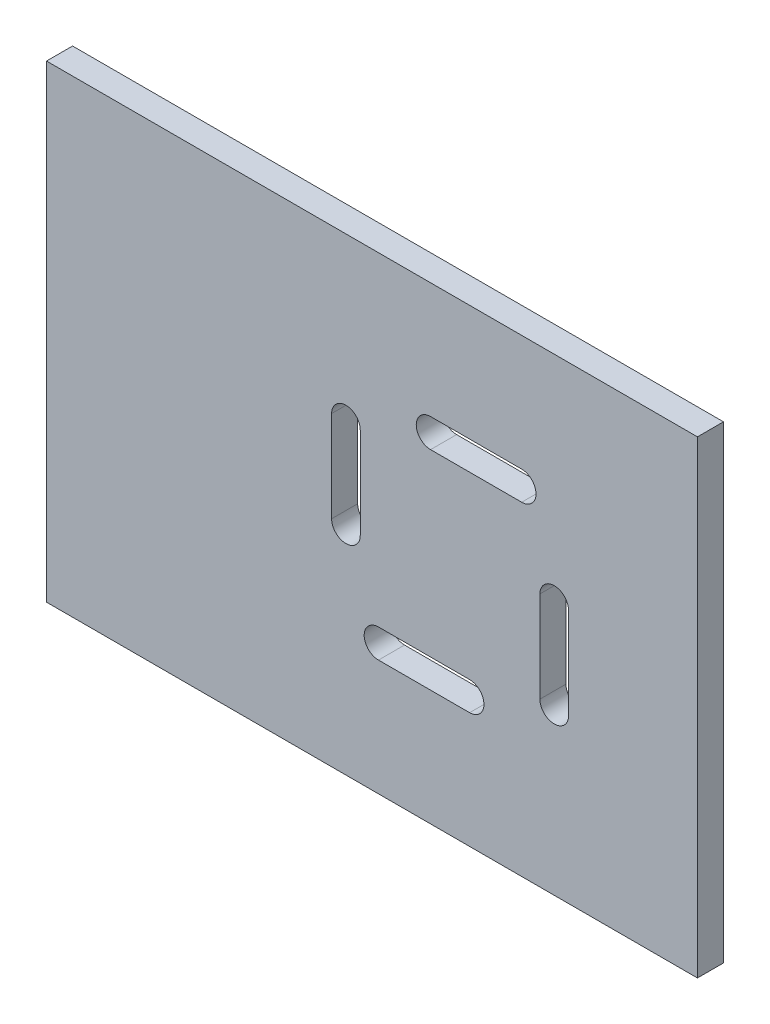
ISO-10303-21;
HEADER;
FILE_DESCRIPTION(('STEP AP214'),'2;1');
FILE_NAME('part.step','',(''),(''),'','','');
FILE_SCHEMA(('AUTOMOTIVE_DESIGN { 1 0 10303 214 1 1 1 1 }'));
ENDSEC;
DATA;
#1=APPLICATION_CONTEXT('core data for automotive mechanical design processes');
#2=APPLICATION_PROTOCOL_DEFINITION('international standard','automotive_design',2000,#1);
#3=PRODUCT_CONTEXT('',#1,'mechanical');
#4=PRODUCT('Part','Part','',(#3));
#5=PRODUCT_RELATED_PRODUCT_CATEGORY('part','',(#4));
#6=PRODUCT_DEFINITION_FORMATION('','',#4);
#7=PRODUCT_DEFINITION_CONTEXT('part definition',#1,'design');
#8=PRODUCT_DEFINITION('design','',#6,#7);
#9=PRODUCT_DEFINITION_SHAPE('','',#8);
#10=(LENGTH_UNIT() NAMED_UNIT(*) SI_UNIT(.MILLI.,.METRE.));
#11=(NAMED_UNIT(*) PLANE_ANGLE_UNIT() SI_UNIT($,.RADIAN.));
#12=(NAMED_UNIT(*) SI_UNIT($,.STERADIAN.) SOLID_ANGLE_UNIT());
#13=UNCERTAINTY_MEASURE_WITH_UNIT(LENGTH_MEASURE(1.E-05),#10,'distance_accuracy_value','');
#14=(GEOMETRIC_REPRESENTATION_CONTEXT(3) GLOBAL_UNCERTAINTY_ASSIGNED_CONTEXT((#13)) GLOBAL_UNIT_ASSIGNED_CONTEXT((#10,
#11,#12)) REPRESENTATION_CONTEXT('',''));
#15=CARTESIAN_POINT('',(0.,0.,0.));
#16=DIRECTION('',(0.,0.,1.));
#17=DIRECTION('',(1.,0.,0.));
#18=AXIS2_PLACEMENT_3D('',#15,#16,#17);
#19=CARTESIAN_POINT('',(-50.,40.,10.));
#20=DIRECTION('',(1.,0.,0.));
#21=DIRECTION('',(0.,1.,0.));
#22=AXIS2_PLACEMENT_3D('',#19,#20,#21);
#23=PLANE('',#22);
#24=DIRECTION('',(0.,-1.,0.));
#25=VECTOR('',#24,1.);
#26=CARTESIAN_POINT('',(-50.,40.,0.));
#27=LINE('',#26,#25);
#28=CARTESIAN_POINT('',(-50.,40.,0.));
#29=VERTEX_POINT('',#28);
#30=CARTESIAN_POINT('',(-50.,-140.,0.));
#31=VERTEX_POINT('',#30);
#32=EDGE_CURVE('E348',#29,#31,#27,.T.);
#33=ORIENTED_EDGE('',*,*,#32,.T.);
#34=DIRECTION('',(0.,0.,-1.));
#35=VECTOR('',#34,1.);
#36=CARTESIAN_POINT('',(-50.,-140.,10.));
#37=LINE('',#36,#35);
#38=CARTESIAN_POINT('',(-50.,-140.,10.));
#39=VERTEX_POINT('',#38);
#40=EDGE_CURVE('E11',#39,#31,#37,.T.);
#41=ORIENTED_EDGE('',*,*,#40,.F.);
#42=DIRECTION('',(0.,-1.,0.));
#43=VECTOR('',#42,1.);
#44=CARTESIAN_POINT('',(-50.,40.,10.));
#45=LINE('',#44,#43);
#46=CARTESIAN_POINT('',(-50.,40.,10.));
#47=VERTEX_POINT('',#46);
#48=EDGE_CURVE('E358',#47,#39,#45,.T.);
#49=ORIENTED_EDGE('',*,*,#48,.F.);
#50=DIRECTION('',(0.,0.,-1.));
#51=VECTOR('',#50,1.);
#52=CARTESIAN_POINT('',(-50.,40.,10.));
#53=LINE('',#52,#51);
#54=EDGE_CURVE('E372',#47,#29,#53,.T.);
#55=ORIENTED_EDGE('',*,*,#54,.T.);
#56=EDGE_LOOP('',(#33,#41,#49,#55));
#57=FACE_BOUND('',#56,.T.);
#58=ADVANCED_FACE('F39',(#57),#23,.F.);
#59=CARTESIAN_POINT('',(-50.,-140.,10.));
#60=DIRECTION('',(0.,1.,0.));
#61=DIRECTION('',(0.,0.,1.));
#62=AXIS2_PLACEMENT_3D('',#59,#60,#61);
#63=PLANE('',#62);
#64=DIRECTION('',(1.,0.,0.));
#65=VECTOR('',#64,1.);
#66=CARTESIAN_POINT('',(-50.,-140.,0.));
#67=LINE('',#66,#65);
#68=CARTESIAN_POINT('',(200.,-140.,0.));
#69=VERTEX_POINT('',#68);
#70=EDGE_CURVE('E376',#31,#69,#67,.T.);
#71=ORIENTED_EDGE('',*,*,#70,.T.);
#72=DIRECTION('',(0.,0.,-1.));
#73=VECTOR('',#72,1.);
#74=CARTESIAN_POINT('',(200.,-140.,10.));
#75=LINE('',#74,#73);
#76=CARTESIAN_POINT('',(200.,-140.,10.));
#77=VERTEX_POINT('',#76);
#78=EDGE_CURVE('E47',#77,#69,#75,.T.);
#79=ORIENTED_EDGE('',*,*,#78,.F.);
#80=DIRECTION('',(1.,0.,0.));
#81=VECTOR('',#80,1.);
#82=CARTESIAN_POINT('',(-50.,-140.,10.));
#83=LINE('',#82,#81);
#84=EDGE_CURVE('E362',#39,#77,#83,.T.);
#85=ORIENTED_EDGE('',*,*,#84,.F.);
#86=ORIENTED_EDGE('',*,*,#40,.T.);
#87=EDGE_LOOP('',(#71,#79,#85,#86));
#88=FACE_BOUND('',#87,.T.);
#89=ADVANCED_FACE('F411',(#88),#63,.F.);
#90=CARTESIAN_POINT('',(200.,40.,10.));
#91=DIRECTION('',(-1.,0.,0.));
#92=DIRECTION('',(0.,-1.,0.));
#93=AXIS2_PLACEMENT_3D('',#90,#91,#92);
#94=PLANE('',#93);
#95=DIRECTION('',(0.,1.,0.));
#96=VECTOR('',#95,1.);
#97=CARTESIAN_POINT('',(200.,40.,0.));
#98=LINE('',#97,#96);
#99=CARTESIAN_POINT('',(200.,40.,0.));
#100=VERTEX_POINT('',#99);
#101=EDGE_CURVE('E379',#69,#100,#98,.T.);
#102=ORIENTED_EDGE('',*,*,#101,.T.);
#103=DIRECTION('',(0.,0.,-1.));
#104=VECTOR('',#103,1.);
#105=CARTESIAN_POINT('',(200.,40.,10.));
#106=LINE('',#105,#104);
#107=CARTESIAN_POINT('',(200.,40.,10.));
#108=VERTEX_POINT('',#107);
#109=EDGE_CURVE('E387',#108,#100,#106,.T.);
#110=ORIENTED_EDGE('',*,*,#109,.F.);
#111=DIRECTION('',(0.,1.,0.));
#112=VECTOR('',#111,1.);
#113=CARTESIAN_POINT('',(200.,40.,10.));
#114=LINE('',#113,#112);
#115=EDGE_CURVE('E366',#77,#108,#114,.T.);
#116=ORIENTED_EDGE('',*,*,#115,.F.);
#117=ORIENTED_EDGE('',*,*,#78,.T.);
#118=EDGE_LOOP('',(#102,#110,#116,#117));
#119=FACE_BOUND('',#118,.T.);
#120=ADVANCED_FACE('F396',(#119),#94,.F.);
#121=CARTESIAN_POINT('',(-50.,40.,10.));
#122=DIRECTION('',(0.,-1.,0.));
#123=DIRECTION('',(0.,0.,-1.));
#124=AXIS2_PLACEMENT_3D('',#121,#122,#123);
#125=PLANE('',#124);
#126=DIRECTION('',(-1.,0.,0.));
#127=VECTOR('',#126,1.);
#128=CARTESIAN_POINT('',(-50.,40.,0.));
#129=LINE('',#128,#127);
#130=EDGE_CURVE('E363',#100,#29,#129,.T.);
#131=ORIENTED_EDGE('',*,*,#130,.T.);
#132=ORIENTED_EDGE('',*,*,#54,.F.);
#133=DIRECTION('',(-1.,0.,0.));
#134=VECTOR('',#133,1.);
#135=CARTESIAN_POINT('',(-50.,40.,10.));
#136=LINE('',#135,#134);
#137=EDGE_CURVE('E369',#108,#47,#136,.T.);
#138=ORIENTED_EDGE('',*,*,#137,.F.);
#139=ORIENTED_EDGE('',*,*,#109,.T.);
#140=EDGE_LOOP('',(#131,#132,#138,#139));
#141=FACE_BOUND('',#140,.T.);
#142=ADVANCED_FACE('F404',(#141),#125,.F.);
#143=CARTESIAN_POINT('',(0.,0.,10.));
#144=DIRECTION('',(0.,0.,1.));
#145=DIRECTION('',(1.,0.,0.));
#146=AXIS2_PLACEMENT_3D('',#143,#144,#145);
#147=PLANE('',#146);
#148=CARTESIAN_POINT('',(77.5000000000002,-90.0000000000001,10.));
#149=DIRECTION('',(0.,0.,1.));
#150=DIRECTION('',(0.,1.,0.));
#151=AXIS2_PLACEMENT_3D('',#148,#149,#150);
#152=CIRCLE('',#151,5.50000000000001);
#153=CARTESIAN_POINT('',(77.5000000000001,-84.5000000000001,10.));
#154=VERTEX_POINT('',#153);
#155=CARTESIAN_POINT('',(77.5000000000002,-95.5000000000001,10.));
#156=VERTEX_POINT('',#155);
#157=EDGE_CURVE('E54',#154,#156,#152,.T.);
#158=ORIENTED_EDGE('',*,*,#157,.F.);
#159=DIRECTION('',(-1.,0.,0.));
#160=VECTOR('',#159,1.);
#161=CARTESIAN_POINT('',(77.5000000000001,-84.5000000000001,10.));
#162=LINE('',#161,#160);
#163=CARTESIAN_POINT('',(112.5,-84.5,10.));
#164=VERTEX_POINT('',#163);
#165=EDGE_CURVE('E200',#164,#154,#162,.T.);
#166=ORIENTED_EDGE('',*,*,#165,.F.);
#167=CARTESIAN_POINT('',(112.5,-90.,10.));
#168=DIRECTION('',(0.,0.,1.));
#169=DIRECTION('',(0.,1.,0.));
#170=AXIS2_PLACEMENT_3D('',#167,#168,#169);
#171=CIRCLE('',#170,5.50000000000001);
#172=CARTESIAN_POINT('',(112.5,-95.5,10.));
#173=VERTEX_POINT('',#172);
#174=EDGE_CURVE('E204',#173,#164,#171,.T.);
#175=ORIENTED_EDGE('',*,*,#174,.F.);
#176=DIRECTION('',(1.,0.,0.));
#177=VECTOR('',#176,1.);
#178=CARTESIAN_POINT('',(77.5000000000002,-95.5000000000001,10.));
#179=LINE('',#178,#177);
#180=EDGE_CURVE('E213',#156,#173,#179,.T.);
#181=ORIENTED_EDGE('',*,*,#180,.F.);
#182=EDGE_LOOP('',(#158,#166,#175,#181));
#183=FACE_BOUND('',#182,.T.);
#184=CARTESIAN_POINT('',(145.,-77.5,10.));
#185=DIRECTION('',(0.,0.,1.));
#186=DIRECTION('',(-1.,0.,0.));
#187=AXIS2_PLACEMENT_3D('',#184,#185,#186);
#188=CIRCLE('',#187,5.50000000000001);
#189=CARTESIAN_POINT('',(139.5,-77.5,10.));
#190=VERTEX_POINT('',#189);
#191=CARTESIAN_POINT('',(150.5,-77.5,10.));
#192=VERTEX_POINT('',#191);
#193=EDGE_CURVE('E62',#190,#192,#188,.T.);
#194=ORIENTED_EDGE('',*,*,#193,.F.);
#195=DIRECTION('',(0.,-1.,0.));
#196=VECTOR('',#195,1.);
#197=CARTESIAN_POINT('',(139.5,-77.5,10.));
#198=LINE('',#197,#196);
#199=CARTESIAN_POINT('',(139.5,-42.5,10.));
#200=VERTEX_POINT('',#199);
#201=EDGE_CURVE('E234',#200,#190,#198,.T.);
#202=ORIENTED_EDGE('',*,*,#201,.F.);
#203=CARTESIAN_POINT('',(145.,-42.5,10.));
#204=DIRECTION('',(0.,0.,1.));
#205=DIRECTION('',(-1.,0.,0.));
#206=AXIS2_PLACEMENT_3D('',#203,#204,#205);
#207=CIRCLE('',#206,5.50000000000001);
#208=CARTESIAN_POINT('',(150.5,-42.5,10.));
#209=VERTEX_POINT('',#208);
#210=EDGE_CURVE('E254',#209,#200,#207,.T.);
#211=ORIENTED_EDGE('',*,*,#210,.F.);
#212=DIRECTION('',(0.,1.,0.));
#213=VECTOR('',#212,1.);
#214=CARTESIAN_POINT('',(150.5,-77.5,10.));
#215=LINE('',#214,#213);
#216=EDGE_CURVE('E249',#192,#209,#215,.T.);
#217=ORIENTED_EDGE('',*,*,#216,.F.);
#218=EDGE_LOOP('',(#194,#202,#211,#217));
#219=FACE_BOUND('',#218,.T.);
#220=CARTESIAN_POINT('',(132.5,-9.99999999999969,10.));
#221=DIRECTION('',(0.,0.,1.));
#222=DIRECTION('',(0.,-1.,0.));
#223=AXIS2_PLACEMENT_3D('',#220,#221,#222);
#224=CIRCLE('',#223,5.50000000000001);
#225=CARTESIAN_POINT('',(132.5,-15.4999999999997,10.));
#226=VERTEX_POINT('',#225);
#227=CARTESIAN_POINT('',(132.5,-4.4999999999997,10.));
#228=VERTEX_POINT('',#227);
#229=EDGE_CURVE('E289',#226,#228,#224,.T.);
#230=ORIENTED_EDGE('',*,*,#229,.F.);
#231=DIRECTION('',(1.,0.,0.));
#232=VECTOR('',#231,1.);
#233=CARTESIAN_POINT('',(132.5,-15.4999999999997,10.));
#234=LINE('',#233,#232);
#235=CARTESIAN_POINT('',(97.4999999999996,-15.5000000000001,10.));
#236=VERTEX_POINT('',#235);
#237=EDGE_CURVE('E276',#236,#226,#234,.T.);
#238=ORIENTED_EDGE('',*,*,#237,.F.);
#239=CARTESIAN_POINT('',(97.4999999999996,-10.,10.));
#240=DIRECTION('',(0.,0.,1.));
#241=DIRECTION('',(0.,-1.,0.));
#242=AXIS2_PLACEMENT_3D('',#239,#240,#241);
#243=CIRCLE('',#242,5.50000000000001);
#244=CARTESIAN_POINT('',(97.4999999999995,-4.50000000000005,10.));
#245=VERTEX_POINT('',#244);
#246=EDGE_CURVE('E296',#245,#236,#243,.T.);
#247=ORIENTED_EDGE('',*,*,#246,.F.);
#248=DIRECTION('',(-1.,0.,0.));
#249=VECTOR('',#248,1.);
#250=CARTESIAN_POINT('',(132.5,-4.4999999999997,10.));
#251=LINE('',#250,#249);
#252=EDGE_CURVE('E292',#228,#245,#251,.T.);
#253=ORIENTED_EDGE('',*,*,#252,.F.);
#254=EDGE_LOOP('',(#230,#238,#247,#253));
#255=FACE_BOUND('',#254,.T.);
#256=CARTESIAN_POINT('',(65.,-22.5,10.));
#257=DIRECTION('',(0.,0.,1.));
#258=DIRECTION('',(1.,0.,0.));
#259=AXIS2_PLACEMENT_3D('',#256,#257,#258);
#260=CIRCLE('',#259,5.50000000000001);
#261=CARTESIAN_POINT('',(70.5,-22.5,10.));
#262=VERTEX_POINT('',#261);
#263=CARTESIAN_POINT('',(59.5,-22.5,10.));
#264=VERTEX_POINT('',#263);
#265=EDGE_CURVE('E223',#262,#264,#260,.T.);
#266=ORIENTED_EDGE('',*,*,#265,.F.);
#267=DIRECTION('',(0.,1.,0.));
#268=VECTOR('',#267,1.);
#269=CARTESIAN_POINT('',(70.5,-22.5,10.));
#270=LINE('',#269,#268);
#271=CARTESIAN_POINT('',(70.5,-57.5,10.));
#272=VERTEX_POINT('',#271);
#273=EDGE_CURVE('E319',#272,#262,#270,.T.);
#274=ORIENTED_EDGE('',*,*,#273,.F.);
#275=CARTESIAN_POINT('',(65.,-57.5,10.));
#276=DIRECTION('',(0.,0.,1.));
#277=DIRECTION('',(1.,0.,0.));
#278=AXIS2_PLACEMENT_3D('',#275,#276,#277);
#279=CIRCLE('',#278,5.50000000000001);
#280=CARTESIAN_POINT('',(59.5,-57.5,10.));
#281=VERTEX_POINT('',#280);
#282=EDGE_CURVE('E338',#281,#272,#279,.T.);
#283=ORIENTED_EDGE('',*,*,#282,.F.);
#284=DIRECTION('',(0.,-1.,0.));
#285=VECTOR('',#284,1.);
#286=CARTESIAN_POINT('',(59.5,-22.5,10.));
#287=LINE('',#286,#285);
#288=EDGE_CURVE('E334',#264,#281,#287,.T.);
#289=ORIENTED_EDGE('',*,*,#288,.F.);
#290=EDGE_LOOP('',(#266,#274,#283,#289));
#291=FACE_BOUND('',#290,.T.);
#292=ORIENTED_EDGE('',*,*,#48,.T.);
#293=ORIENTED_EDGE('',*,*,#84,.T.);
#294=ORIENTED_EDGE('',*,*,#115,.T.);
#295=ORIENTED_EDGE('',*,*,#137,.T.);
#296=EDGE_LOOP('',(#292,#293,#294,#295));
#297=FACE_BOUND('',#296,.T.);
#298=ADVANCED_FACE('F410',(#183,#219,#255,#291,#297),#147,.T.);
#299=CARTESIAN_POINT('',(0.,0.,0.));
#300=DIRECTION('',(0.,0.,1.));
#301=DIRECTION('',(1.,0.,0.));
#302=AXIS2_PLACEMENT_3D('',#299,#300,#301);
#303=PLANE('',#302);
#304=DIRECTION('',(-1.,0.,0.));
#305=VECTOR('',#304,1.);
#306=CARTESIAN_POINT('',(77.5000000000001,-84.5000000000001,0.));
#307=LINE('',#306,#305);
#308=CARTESIAN_POINT('',(112.5,-84.5,0.));
#309=VERTEX_POINT('',#308);
#310=CARTESIAN_POINT('',(77.5000000000001,-84.5000000000001,0.));
#311=VERTEX_POINT('',#310);
#312=EDGE_CURVE('E185',#309,#311,#307,.T.);
#313=ORIENTED_EDGE('',*,*,#312,.T.);
#314=CARTESIAN_POINT('',(77.5000000000002,-90.0000000000001,0.));
#315=DIRECTION('',(0.,0.,1.));
#316=DIRECTION('',(0.,1.,0.));
#317=AXIS2_PLACEMENT_3D('',#314,#315,#316);
#318=CIRCLE('',#317,5.50000000000001);
#319=CARTESIAN_POINT('',(77.5000000000002,-95.5000000000001,0.));
#320=VERTEX_POINT('',#319);
#321=EDGE_CURVE('E178',#311,#320,#318,.T.);
#322=ORIENTED_EDGE('',*,*,#321,.T.);
#323=DIRECTION('',(1.,0.,0.));
#324=VECTOR('',#323,1.);
#325=CARTESIAN_POINT('',(77.5000000000002,-95.5000000000001,0.));
#326=LINE('',#325,#324);
#327=CARTESIAN_POINT('',(112.5,-95.5,0.));
#328=VERTEX_POINT('',#327);
#329=EDGE_CURVE('E189',#320,#328,#326,.T.);
#330=ORIENTED_EDGE('',*,*,#329,.T.);
#331=CARTESIAN_POINT('',(112.5,-90.,0.));
#332=DIRECTION('',(0.,0.,1.));
#333=DIRECTION('',(0.,1.,0.));
#334=AXIS2_PLACEMENT_3D('',#331,#332,#333);
#335=CIRCLE('',#334,5.50000000000001);
#336=EDGE_CURVE('E194',#328,#309,#335,.T.);
#337=ORIENTED_EDGE('',*,*,#336,.T.);
#338=EDGE_LOOP('',(#313,#322,#330,#337));
#339=FACE_BOUND('',#338,.T.);
#340=DIRECTION('',(0.,-1.,0.));
#341=VECTOR('',#340,1.);
#342=CARTESIAN_POINT('',(139.5,-77.5,0.));
#343=LINE('',#342,#341);
#344=CARTESIAN_POINT('',(139.5,-42.5,0.));
#345=VERTEX_POINT('',#344);
#346=CARTESIAN_POINT('',(139.5,-77.5,0.));
#347=VERTEX_POINT('',#346);
#348=EDGE_CURVE('E242',#345,#347,#343,.T.);
#349=ORIENTED_EDGE('',*,*,#348,.T.);
#350=CARTESIAN_POINT('',(145.,-77.5,0.));
#351=DIRECTION('',(0.,0.,1.));
#352=DIRECTION('',(-1.,0.,0.));
#353=AXIS2_PLACEMENT_3D('',#350,#351,#352);
#354=CIRCLE('',#353,5.50000000000001);
#355=CARTESIAN_POINT('',(150.5,-77.5,0.));
#356=VERTEX_POINT('',#355);
#357=EDGE_CURVE('E229',#347,#356,#354,.T.);
#358=ORIENTED_EDGE('',*,*,#357,.T.);
#359=DIRECTION('',(0.,1.,0.));
#360=VECTOR('',#359,1.);
#361=CARTESIAN_POINT('',(150.5,-77.5,0.));
#362=LINE('',#361,#360);
#363=CARTESIAN_POINT('',(150.5,-42.5,0.));
#364=VERTEX_POINT('',#363);
#365=EDGE_CURVE('E233',#356,#364,#362,.T.);
#366=ORIENTED_EDGE('',*,*,#365,.T.);
#367=CARTESIAN_POINT('',(145.,-42.5,0.));
#368=DIRECTION('',(0.,0.,1.));
#369=DIRECTION('',(-1.,0.,0.));
#370=AXIS2_PLACEMENT_3D('',#367,#368,#369);
#371=CIRCLE('',#370,5.50000000000001);
#372=EDGE_CURVE('E238',#364,#345,#371,.T.);
#373=ORIENTED_EDGE('',*,*,#372,.T.);
#374=EDGE_LOOP('',(#349,#358,#366,#373));
#375=FACE_BOUND('',#374,.T.);
#376=DIRECTION('',(1.,0.,0.));
#377=VECTOR('',#376,1.);
#378=CARTESIAN_POINT('',(132.5,-15.4999999999997,0.));
#379=LINE('',#378,#377);
#380=CARTESIAN_POINT('',(97.4999999999996,-15.5000000000001,0.));
#381=VERTEX_POINT('',#380);
#382=CARTESIAN_POINT('',(132.5,-15.4999999999997,0.));
#383=VERTEX_POINT('',#382);
#384=EDGE_CURVE('E284',#381,#383,#379,.T.);
#385=ORIENTED_EDGE('',*,*,#384,.T.);
#386=CARTESIAN_POINT('',(132.5,-9.99999999999969,0.));
#387=DIRECTION('',(0.,0.,1.));
#388=DIRECTION('',(0.,-1.,0.));
#389=AXIS2_PLACEMENT_3D('',#386,#387,#388);
#390=CIRCLE('',#389,5.50000000000001);
#391=CARTESIAN_POINT('',(132.5,-4.4999999999997,0.));
#392=VERTEX_POINT('',#391);
#393=EDGE_CURVE('E271',#383,#392,#390,.T.);
#394=ORIENTED_EDGE('',*,*,#393,.T.);
#395=DIRECTION('',(-1.,0.,0.));
#396=VECTOR('',#395,1.);
#397=CARTESIAN_POINT('',(132.5,-4.4999999999997,0.));
#398=LINE('',#397,#396);
#399=CARTESIAN_POINT('',(97.4999999999995,-4.50000000000007,0.));
#400=VERTEX_POINT('',#399);
#401=EDGE_CURVE('E275',#392,#400,#398,.T.);
#402=ORIENTED_EDGE('',*,*,#401,.T.);
#403=CARTESIAN_POINT('',(97.4999999999996,-10.,0.));
#404=DIRECTION('',(0.,0.,1.));
#405=DIRECTION('',(0.,-1.,0.));
#406=AXIS2_PLACEMENT_3D('',#403,#404,#405);
#407=CIRCLE('',#406,5.50000000000001);
#408=EDGE_CURVE('E280',#400,#381,#407,.T.);
#409=ORIENTED_EDGE('',*,*,#408,.T.);
#410=EDGE_LOOP('',(#385,#394,#402,#409));
#411=FACE_BOUND('',#410,.T.);
#412=DIRECTION('',(0.,1.,0.));
#413=VECTOR('',#412,1.);
#414=CARTESIAN_POINT('',(70.5,-22.5,0.));
#415=LINE('',#414,#413);
#416=CARTESIAN_POINT('',(70.5,-57.5,0.));
#417=VERTEX_POINT('',#416);
#418=CARTESIAN_POINT('',(70.5,-22.5,0.));
#419=VERTEX_POINT('',#418);
#420=EDGE_CURVE('E327',#417,#419,#415,.T.);
#421=ORIENTED_EDGE('',*,*,#420,.T.);
#422=CARTESIAN_POINT('',(65.,-22.5,0.));
#423=DIRECTION('',(0.,0.,1.));
#424=DIRECTION('',(1.,0.,0.));
#425=AXIS2_PLACEMENT_3D('',#422,#423,#424);
#426=CIRCLE('',#425,5.50000000000001);
#427=CARTESIAN_POINT('',(59.5,-22.5,0.));
#428=VERTEX_POINT('',#427);
#429=EDGE_CURVE('E314',#419,#428,#426,.T.);
#430=ORIENTED_EDGE('',*,*,#429,.T.);
#431=DIRECTION('',(0.,-1.,0.));
#432=VECTOR('',#431,1.);
#433=CARTESIAN_POINT('',(59.5,-22.5,0.));
#434=LINE('',#433,#432);
#435=CARTESIAN_POINT('',(59.5,-57.5,0.));
#436=VERTEX_POINT('',#435);
#437=EDGE_CURVE('E318',#428,#436,#434,.T.);
#438=ORIENTED_EDGE('',*,*,#437,.T.);
#439=CARTESIAN_POINT('',(65.,-57.5,0.));
#440=DIRECTION('',(0.,0.,1.));
#441=DIRECTION('',(1.,0.,0.));
#442=AXIS2_PLACEMENT_3D('',#439,#440,#441);
#443=CIRCLE('',#442,5.50000000000001);
#444=EDGE_CURVE('E323',#436,#417,#443,.T.);
#445=ORIENTED_EDGE('',*,*,#444,.T.);
#446=EDGE_LOOP('',(#421,#430,#438,#445));
#447=FACE_BOUND('',#446,.T.);
#448=ORIENTED_EDGE('',*,*,#32,.F.);
#449=ORIENTED_EDGE('',*,*,#130,.F.);
#450=ORIENTED_EDGE('',*,*,#101,.F.);
#451=ORIENTED_EDGE('',*,*,#70,.F.);
#452=EDGE_LOOP('',(#448,#449,#450,#451));
#453=FACE_BOUND('',#452,.T.);
#454=ADVANCED_FACE('F196',(#339,#375,#411,#447,#453),#303,.F.);
#455=CARTESIAN_POINT('',(65.,-22.5,0.));
#456=DIRECTION('',(0.,0.,1.));
#457=DIRECTION('',(1.,0.,0.));
#458=AXIS2_PLACEMENT_3D('',#455,#456,#457);
#459=CYLINDRICAL_SURFACE('',#458,5.50000000000001);
#460=ORIENTED_EDGE('',*,*,#265,.T.);
#461=DIRECTION('',(0.,0.,1.));
#462=VECTOR('',#461,1.);
#463=CARTESIAN_POINT('',(59.5,-22.5,0.));
#464=LINE('',#463,#462);
#465=EDGE_CURVE('E331',#428,#264,#464,.T.);
#466=ORIENTED_EDGE('',*,*,#465,.F.);
#467=ORIENTED_EDGE('',*,*,#429,.F.);
#468=DIRECTION('',(0.,0.,1.));
#469=VECTOR('',#468,1.);
#470=CARTESIAN_POINT('',(70.5,-22.5,0.));
#471=LINE('',#470,#469);
#472=EDGE_CURVE('E345',#419,#262,#471,.T.);
#473=ORIENTED_EDGE('',*,*,#472,.T.);
#474=EDGE_LOOP('',(#460,#466,#467,#473));
#475=FACE_BOUND('',#474,.T.);
#476=ADVANCED_FACE('F423',(#475),#459,.F.);
#477=CARTESIAN_POINT('',(70.5,-22.5,0.));
#478=DIRECTION('',(1.,0.,0.));
#479=DIRECTION('',(0.,0.,-1.));
#480=AXIS2_PLACEMENT_3D('',#477,#478,#479);
#481=PLANE('',#480);
#482=ORIENTED_EDGE('',*,*,#273,.T.);
#483=ORIENTED_EDGE('',*,*,#472,.F.);
#484=ORIENTED_EDGE('',*,*,#420,.F.);
#485=DIRECTION('',(0.,0.,1.));
#486=VECTOR('',#485,1.);
#487=CARTESIAN_POINT('',(70.5,-57.5,0.));
#488=LINE('',#487,#486);
#489=EDGE_CURVE('E349',#417,#272,#488,.T.);
#490=ORIENTED_EDGE('',*,*,#489,.T.);
#491=EDGE_LOOP('',(#482,#483,#484,#490));
#492=FACE_BOUND('',#491,.T.);
#493=ADVANCED_FACE('F429',(#492),#481,.F.);
#494=CARTESIAN_POINT('',(65.,-57.5,0.));
#495=DIRECTION('',(0.,0.,1.));
#496=DIRECTION('',(1.,0.,0.));
#497=AXIS2_PLACEMENT_3D('',#494,#495,#496);
#498=CYLINDRICAL_SURFACE('',#497,5.50000000000001);
#499=ORIENTED_EDGE('',*,*,#282,.T.);
#500=ORIENTED_EDGE('',*,*,#489,.F.);
#501=ORIENTED_EDGE('',*,*,#444,.F.);
#502=DIRECTION('',(0.,0.,1.));
#503=VECTOR('',#502,1.);
#504=CARTESIAN_POINT('',(59.5,-57.5,0.));
#505=LINE('',#504,#503);
#506=EDGE_CURVE('E352',#436,#281,#505,.T.);
#507=ORIENTED_EDGE('',*,*,#506,.T.);
#508=EDGE_LOOP('',(#499,#500,#501,#507));
#509=FACE_BOUND('',#508,.T.);
#510=ADVANCED_FACE('F435',(#509),#498,.F.);
#511=CARTESIAN_POINT('',(59.5,-22.5,0.));
#512=DIRECTION('',(-1.,0.,0.));
#513=DIRECTION('',(0.,0.,1.));
#514=AXIS2_PLACEMENT_3D('',#511,#512,#513);
#515=PLANE('',#514);
#516=ORIENTED_EDGE('',*,*,#288,.T.);
#517=ORIENTED_EDGE('',*,*,#506,.F.);
#518=ORIENTED_EDGE('',*,*,#437,.F.);
#519=ORIENTED_EDGE('',*,*,#465,.T.);
#520=EDGE_LOOP('',(#516,#517,#518,#519));
#521=FACE_BOUND('',#520,.T.);
#522=ADVANCED_FACE('F431',(#521),#515,.F.);
#523=CARTESIAN_POINT('',(132.5,-9.99999999999969,0.));
#524=DIRECTION('',(0.,0.,1.));
#525=DIRECTION('',(1.,0.,0.));
#526=AXIS2_PLACEMENT_3D('',#523,#524,#525);
#527=CYLINDRICAL_SURFACE('',#526,5.50000000000001);
#528=ORIENTED_EDGE('',*,*,#229,.T.);
#529=DIRECTION('',(0.,0.,1.));
#530=VECTOR('',#529,1.);
#531=CARTESIAN_POINT('',(132.5,-4.4999999999997,0.));
#532=LINE('',#531,#530);
#533=EDGE_CURVE('E288',#392,#228,#532,.T.);
#534=ORIENTED_EDGE('',*,*,#533,.F.);
#535=ORIENTED_EDGE('',*,*,#393,.F.);
#536=DIRECTION('',(0.,0.,1.));
#537=VECTOR('',#536,1.);
#538=CARTESIAN_POINT('',(132.5,-15.4999999999997,0.));
#539=LINE('',#538,#537);
#540=EDGE_CURVE('E250',#383,#226,#539,.T.);
#541=ORIENTED_EDGE('',*,*,#540,.T.);
#542=EDGE_LOOP('',(#528,#534,#535,#541));
#543=FACE_BOUND('',#542,.T.);
#544=ADVANCED_FACE('F434',(#543),#527,.F.);
#545=CARTESIAN_POINT('',(132.5,-15.4999999999997,0.));
#546=DIRECTION('',(0.,-1.,0.));
#547=DIRECTION('',(1.,0.,0.));
#548=AXIS2_PLACEMENT_3D('',#545,#546,#547);
#549=PLANE('',#548);
#550=ORIENTED_EDGE('',*,*,#237,.T.);
#551=ORIENTED_EDGE('',*,*,#540,.F.);
#552=ORIENTED_EDGE('',*,*,#384,.F.);
#553=DIRECTION('',(0.,0.,1.));
#554=VECTOR('',#553,1.);
#555=CARTESIAN_POINT('',(97.4999999999996,-15.5000000000001,0.));
#556=LINE('',#555,#554);
#557=EDGE_CURVE('E305',#381,#236,#556,.T.);
#558=ORIENTED_EDGE('',*,*,#557,.T.);
#559=EDGE_LOOP('',(#550,#551,#552,#558));
#560=FACE_BOUND('',#559,.T.);
#561=ADVANCED_FACE('F445',(#560),#549,.F.);
#562=CARTESIAN_POINT('',(97.4999999999996,-10.,0.));
#563=DIRECTION('',(0.,0.,1.));
#564=DIRECTION('',(1.,0.,0.));
#565=AXIS2_PLACEMENT_3D('',#562,#563,#564);
#566=CYLINDRICAL_SURFACE('',#565,5.50000000000001);
#567=ORIENTED_EDGE('',*,*,#246,.T.);
#568=ORIENTED_EDGE('',*,*,#557,.F.);
#569=ORIENTED_EDGE('',*,*,#408,.F.);
#570=DIRECTION('',(0.,0.,1.));
#571=VECTOR('',#570,1.);
#572=CARTESIAN_POINT('',(97.4999999999995,-4.50000000000005,0.));
#573=LINE('',#572,#571);
#574=EDGE_CURVE('E308',#400,#245,#573,.T.);
#575=ORIENTED_EDGE('',*,*,#574,.T.);
#576=EDGE_LOOP('',(#567,#568,#569,#575));
#577=FACE_BOUND('',#576,.T.);
#578=ADVANCED_FACE('F451',(#577),#566,.F.);
#579=CARTESIAN_POINT('',(132.5,-4.4999999999997,0.));
#580=DIRECTION('',(0.,1.,0.));
#581=DIRECTION('',(-1.,0.,0.));
#582=AXIS2_PLACEMENT_3D('',#579,#580,#581);
#583=PLANE('',#582);
#584=ORIENTED_EDGE('',*,*,#252,.T.);
#585=ORIENTED_EDGE('',*,*,#574,.F.);
#586=ORIENTED_EDGE('',*,*,#401,.F.);
#587=ORIENTED_EDGE('',*,*,#533,.T.);
#588=EDGE_LOOP('',(#584,#585,#586,#587));
#589=FACE_BOUND('',#588,.T.);
#590=ADVANCED_FACE('F447',(#589),#583,.F.);
#591=CARTESIAN_POINT('',(145.,-77.5,0.));
#592=DIRECTION('',(0.,0.,1.));
#593=DIRECTION('',(1.,0.,0.));
#594=AXIS2_PLACEMENT_3D('',#591,#592,#593);
#595=CYLINDRICAL_SURFACE('',#594,5.50000000000001);
#596=ORIENTED_EDGE('',*,*,#193,.T.);
#597=DIRECTION('',(0.,0.,1.));
#598=VECTOR('',#597,1.);
#599=CARTESIAN_POINT('',(150.5,-77.5,0.));
#600=LINE('',#599,#598);
#601=EDGE_CURVE('E246',#356,#192,#600,.T.);
#602=ORIENTED_EDGE('',*,*,#601,.F.);
#603=ORIENTED_EDGE('',*,*,#357,.F.);
#604=DIRECTION('',(0.,0.,1.));
#605=VECTOR('',#604,1.);
#606=CARTESIAN_POINT('',(139.5,-77.5,0.));
#607=LINE('',#606,#605);
#608=EDGE_CURVE('E214',#347,#190,#607,.T.);
#609=ORIENTED_EDGE('',*,*,#608,.T.);
#610=EDGE_LOOP('',(#596,#602,#603,#609));
#611=FACE_BOUND('',#610,.T.);
#612=ADVANCED_FACE('F450',(#611),#595,.F.);
#613=CARTESIAN_POINT('',(139.5,-77.5,0.));
#614=DIRECTION('',(-1.,0.,0.));
#615=DIRECTION('',(0.,0.,1.));
#616=AXIS2_PLACEMENT_3D('',#613,#614,#615);
#617=PLANE('',#616);
#618=ORIENTED_EDGE('',*,*,#201,.T.);
#619=ORIENTED_EDGE('',*,*,#608,.F.);
#620=ORIENTED_EDGE('',*,*,#348,.F.);
#621=DIRECTION('',(0.,0.,1.));
#622=VECTOR('',#621,1.);
#623=CARTESIAN_POINT('',(139.5,-42.5,0.));
#624=LINE('',#623,#622);
#625=EDGE_CURVE('E263',#345,#200,#624,.T.);
#626=ORIENTED_EDGE('',*,*,#625,.T.);
#627=EDGE_LOOP('',(#618,#619,#620,#626));
#628=FACE_BOUND('',#627,.T.);
#629=ADVANCED_FACE('F461',(#628),#617,.F.);
#630=CARTESIAN_POINT('',(145.,-42.5,0.));
#631=DIRECTION('',(0.,0.,1.));
#632=DIRECTION('',(1.,0.,0.));
#633=AXIS2_PLACEMENT_3D('',#630,#631,#632);
#634=CYLINDRICAL_SURFACE('',#633,5.50000000000001);
#635=ORIENTED_EDGE('',*,*,#210,.T.);
#636=ORIENTED_EDGE('',*,*,#625,.F.);
#637=ORIENTED_EDGE('',*,*,#372,.F.);
#638=DIRECTION('',(0.,0.,1.));
#639=VECTOR('',#638,1.);
#640=CARTESIAN_POINT('',(150.5,-42.5,0.));
#641=LINE('',#640,#639);
#642=EDGE_CURVE('E266',#364,#209,#641,.T.);
#643=ORIENTED_EDGE('',*,*,#642,.T.);
#644=EDGE_LOOP('',(#635,#636,#637,#643));
#645=FACE_BOUND('',#644,.T.);
#646=ADVANCED_FACE('F465',(#645),#634,.F.);
#647=CARTESIAN_POINT('',(150.5,-77.5,0.));
#648=DIRECTION('',(1.,0.,0.));
#649=DIRECTION('',(0.,0.,-1.));
#650=AXIS2_PLACEMENT_3D('',#647,#648,#649);
#651=PLANE('',#650);
#652=ORIENTED_EDGE('',*,*,#216,.T.);
#653=ORIENTED_EDGE('',*,*,#642,.F.);
#654=ORIENTED_EDGE('',*,*,#365,.F.);
#655=ORIENTED_EDGE('',*,*,#601,.T.);
#656=EDGE_LOOP('',(#652,#653,#654,#655));
#657=FACE_BOUND('',#656,.T.);
#658=ADVANCED_FACE('F462',(#657),#651,.F.);
#659=CARTESIAN_POINT('',(77.5000000000002,-90.0000000000001,0.));
#660=DIRECTION('',(0.,0.,1.));
#661=DIRECTION('',(1.,0.,0.));
#662=AXIS2_PLACEMENT_3D('',#659,#660,#661);
#663=CYLINDRICAL_SURFACE('',#662,5.50000000000001);
#664=ORIENTED_EDGE('',*,*,#157,.T.);
#665=DIRECTION('',(0.,0.,1.));
#666=VECTOR('',#665,1.);
#667=CARTESIAN_POINT('',(77.5000000000002,-95.5000000000001,0.));
#668=LINE('',#667,#666);
#669=EDGE_CURVE('E174',#320,#156,#668,.T.);
#670=ORIENTED_EDGE('',*,*,#669,.F.);
#671=ORIENTED_EDGE('',*,*,#321,.F.);
#672=DIRECTION('',(0.,0.,1.));
#673=VECTOR('',#672,1.);
#674=CARTESIAN_POINT('',(77.5000000000001,-84.5000000000001,0.));
#675=LINE('',#674,#673);
#676=EDGE_CURVE('E220',#311,#154,#675,.T.);
#677=ORIENTED_EDGE('',*,*,#676,.T.);
#678=EDGE_LOOP('',(#664,#670,#671,#677));
#679=FACE_BOUND('',#678,.T.);
#680=ADVANCED_FACE('F176',(#679),#663,.F.);
#681=CARTESIAN_POINT('',(77.5000000000001,-84.5000000000001,0.));
#682=DIRECTION('',(0.,1.,0.));
#683=DIRECTION('',(-1.,0.,0.));
#684=AXIS2_PLACEMENT_3D('',#681,#682,#683);
#685=PLANE('',#684);
#686=ORIENTED_EDGE('',*,*,#165,.T.);
#687=ORIENTED_EDGE('',*,*,#676,.F.);
#688=ORIENTED_EDGE('',*,*,#312,.F.);
#689=DIRECTION('',(0.,0.,1.));
#690=VECTOR('',#689,1.);
#691=CARTESIAN_POINT('',(112.5,-84.5,0.));
#692=LINE('',#691,#690);
#693=EDGE_CURVE('E224',#309,#164,#692,.T.);
#694=ORIENTED_EDGE('',*,*,#693,.T.);
#695=EDGE_LOOP('',(#686,#687,#688,#694));
#696=FACE_BOUND('',#695,.T.);
#697=ADVANCED_FACE('F475',(#696),#685,.F.);
#698=CARTESIAN_POINT('',(112.5,-90.,0.));
#699=DIRECTION('',(0.,0.,1.));
#700=DIRECTION('',(1.,0.,0.));
#701=AXIS2_PLACEMENT_3D('',#698,#699,#700);
#702=CYLINDRICAL_SURFACE('',#701,5.50000000000001);
#703=ORIENTED_EDGE('',*,*,#174,.T.);
#704=ORIENTED_EDGE('',*,*,#693,.F.);
#705=ORIENTED_EDGE('',*,*,#336,.F.);
#706=DIRECTION('',(0.,0.,1.));
#707=VECTOR('',#706,1.);
#708=CARTESIAN_POINT('',(112.5,-95.5,0.));
#709=LINE('',#708,#707);
#710=EDGE_CURVE('E184',#328,#173,#709,.T.);
#711=ORIENTED_EDGE('',*,*,#710,.T.);
#712=EDGE_LOOP('',(#703,#704,#705,#711));
#713=FACE_BOUND('',#712,.T.);
#714=ADVANCED_FACE('F478',(#713),#702,.F.);
#715=CARTESIAN_POINT('',(77.5000000000002,-95.5000000000001,0.));
#716=DIRECTION('',(0.,-1.,0.));
#717=DIRECTION('',(1.,0.,0.));
#718=AXIS2_PLACEMENT_3D('',#715,#716,#717);
#719=PLANE('',#718);
#720=ORIENTED_EDGE('',*,*,#180,.T.);
#721=ORIENTED_EDGE('',*,*,#710,.F.);
#722=ORIENTED_EDGE('',*,*,#329,.F.);
#723=ORIENTED_EDGE('',*,*,#669,.T.);
#724=EDGE_LOOP('',(#720,#721,#722,#723));
#725=FACE_BOUND('',#724,.T.);
#726=ADVANCED_FACE('F190',(#725),#719,.F.);
#727=CLOSED_SHELL('',(#58,#89,#120,#142,#298,#454,#476,#493,#510,#522,#544,#561,#578,#590,#612,
#629,#646,#658,#680,#697,#714,#726));
#728=MANIFOLD_SOLID_BREP('B2',#727);
#729=ADVANCED_BREP_SHAPE_REPRESENTATION('',(#18,#728),#14);
#730=SHAPE_DEFINITION_REPRESENTATION(#9,#729);
ENDSEC;
END-ISO-10303-21;
